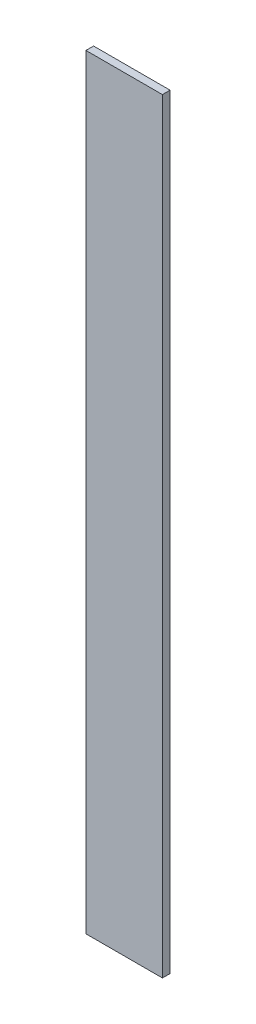
ISO-10303-21;
HEADER;
FILE_DESCRIPTION(('STEP AP214'),'2;1');
FILE_NAME('part.step','',(''),(''),'','','');
FILE_SCHEMA(('AUTOMOTIVE_DESIGN { 1 0 10303 214 1 1 1 1 }'));
ENDSEC;
DATA;
#1=APPLICATION_CONTEXT('core data for automotive mechanical design processes');
#2=APPLICATION_PROTOCOL_DEFINITION('international standard','automotive_design',2000,#1);
#3=PRODUCT_CONTEXT('',#1,'mechanical');
#4=PRODUCT('Part','Part','',(#3));
#5=PRODUCT_RELATED_PRODUCT_CATEGORY('part','',(#4));
#6=PRODUCT_DEFINITION_FORMATION('','',#4);
#7=PRODUCT_DEFINITION_CONTEXT('part definition',#1,'design');
#8=PRODUCT_DEFINITION('design','',#6,#7);
#9=PRODUCT_DEFINITION_SHAPE('','',#8);
#10=(LENGTH_UNIT() NAMED_UNIT(*) SI_UNIT(.MILLI.,.METRE.));
#11=(NAMED_UNIT(*) PLANE_ANGLE_UNIT() SI_UNIT($,.RADIAN.));
#12=(NAMED_UNIT(*) SI_UNIT($,.STERADIAN.) SOLID_ANGLE_UNIT());
#13=UNCERTAINTY_MEASURE_WITH_UNIT(LENGTH_MEASURE(1.E-05),#10,'distance_accuracy_value','');
#14=(GEOMETRIC_REPRESENTATION_CONTEXT(3) GLOBAL_UNCERTAINTY_ASSIGNED_CONTEXT((#13)) GLOBAL_UNIT_ASSIGNED_CONTEXT((#10,
#11,#12)) REPRESENTATION_CONTEXT('',''));
#15=CARTESIAN_POINT('',(0.,0.,0.));
#16=DIRECTION('',(0.,0.,1.));
#17=DIRECTION('',(1.,0.,0.));
#18=AXIS2_PLACEMENT_3D('',#15,#16,#17);
#19=CARTESIAN_POINT('',(10.,-100.,2.));
#20=DIRECTION('',(-1.,0.,0.));
#21=DIRECTION('',(0.,0.,1.));
#22=AXIS2_PLACEMENT_3D('',#19,#20,#21);
#23=PLANE('',#22);
#24=DIRECTION('',(0.,1.,0.));
#25=VECTOR('',#24,1.);
#26=CARTESIAN_POINT('',(10.,-100.,0.));
#27=LINE('',#26,#25);
#28=CARTESIAN_POINT('',(10.,-100.,0.));
#29=VERTEX_POINT('',#28);
#30=CARTESIAN_POINT('',(10.,100.,0.));
#31=VERTEX_POINT('',#30);
#32=EDGE_CURVE('E98',#29,#31,#27,.T.);
#33=ORIENTED_EDGE('',*,*,#32,.T.);
#34=DIRECTION('',(0.,0.,-1.));
#35=VECTOR('',#34,1.);
#36=CARTESIAN_POINT('',(10.,100.,2.));
#37=LINE('',#36,#35);
#38=CARTESIAN_POINT('',(10.,100.,2.));
#39=VERTEX_POINT('',#38);
#40=EDGE_CURVE('E11',#39,#31,#37,.T.);
#41=ORIENTED_EDGE('',*,*,#40,.F.);
#42=DIRECTION('',(0.,1.,0.));
#43=VECTOR('',#42,1.);
#44=CARTESIAN_POINT('',(10.,-100.,2.));
#45=LINE('',#44,#43);
#46=CARTESIAN_POINT('',(10.,-100.,2.));
#47=VERTEX_POINT('',#46);
#48=EDGE_CURVE('E86',#47,#39,#45,.T.);
#49=ORIENTED_EDGE('',*,*,#48,.F.);
#50=DIRECTION('',(0.,0.,-1.));
#51=VECTOR('',#50,1.);
#52=CARTESIAN_POINT('',(10.,-100.,2.));
#53=LINE('',#52,#51);
#54=EDGE_CURVE('E94',#47,#29,#53,.T.);
#55=ORIENTED_EDGE('',*,*,#54,.T.);
#56=EDGE_LOOP('',(#33,#41,#49,#55));
#57=FACE_BOUND('',#56,.T.);
#58=ADVANCED_FACE('F35',(#57),#23,.F.);
#59=CARTESIAN_POINT('',(-10.,100.,2.));
#60=DIRECTION('',(0.,-1.,0.));
#61=DIRECTION('',(0.,0.,-1.));
#62=AXIS2_PLACEMENT_3D('',#59,#60,#61);
#63=PLANE('',#62);
#64=DIRECTION('',(-1.,0.,0.));
#65=VECTOR('',#64,1.);
#66=CARTESIAN_POINT('',(-10.,100.,0.));
#67=LINE('',#66,#65);
#68=CARTESIAN_POINT('',(-10.,100.,0.));
#69=VERTEX_POINT('',#68);
#70=EDGE_CURVE('E90',#31,#69,#67,.T.);
#71=ORIENTED_EDGE('',*,*,#70,.T.);
#72=DIRECTION('',(0.,0.,-1.));
#73=VECTOR('',#72,1.);
#74=CARTESIAN_POINT('',(-10.,100.,2.));
#75=LINE('',#74,#73);
#76=CARTESIAN_POINT('',(-10.,100.,2.));
#77=VERTEX_POINT('',#76);
#78=EDGE_CURVE('E43',#77,#69,#75,.T.);
#79=ORIENTED_EDGE('',*,*,#78,.F.);
#80=DIRECTION('',(-1.,0.,0.));
#81=VECTOR('',#80,1.);
#82=CARTESIAN_POINT('',(-10.,100.,2.));
#83=LINE('',#82,#81);
#84=EDGE_CURVE('E81',#39,#77,#83,.T.);
#85=ORIENTED_EDGE('',*,*,#84,.F.);
#86=ORIENTED_EDGE('',*,*,#40,.T.);
#87=EDGE_LOOP('',(#71,#79,#85,#86));
#88=FACE_BOUND('',#87,.T.);
#89=ADVANCED_FACE('F89',(#88),#63,.F.);
#90=CARTESIAN_POINT('',(-10.,-100.,2.));
#91=DIRECTION('',(1.,0.,0.));
#92=DIRECTION('',(0.,0.,-1.));
#93=AXIS2_PLACEMENT_3D('',#90,#91,#92);
#94=PLANE('',#93);
#95=DIRECTION('',(0.,-1.,0.));
#96=VECTOR('',#95,1.);
#97=CARTESIAN_POINT('',(-10.,-100.,0.));
#98=LINE('',#97,#96);
#99=CARTESIAN_POINT('',(-10.,-100.,0.));
#100=VERTEX_POINT('',#99);
#101=EDGE_CURVE('E68',#69,#100,#98,.T.);
#102=ORIENTED_EDGE('',*,*,#101,.T.);
#103=DIRECTION('',(0.,0.,-1.));
#104=VECTOR('',#103,1.);
#105=CARTESIAN_POINT('',(-10.,-100.,2.));
#106=LINE('',#105,#104);
#107=CARTESIAN_POINT('',(-10.,-100.,2.));
#108=VERTEX_POINT('',#107);
#109=EDGE_CURVE('E91',#108,#100,#106,.T.);
#110=ORIENTED_EDGE('',*,*,#109,.F.);
#111=DIRECTION('',(0.,-1.,0.));
#112=VECTOR('',#111,1.);
#113=CARTESIAN_POINT('',(-10.,-100.,2.));
#114=LINE('',#113,#112);
#115=EDGE_CURVE('E84',#77,#108,#114,.T.);
#116=ORIENTED_EDGE('',*,*,#115,.F.);
#117=ORIENTED_EDGE('',*,*,#78,.T.);
#118=EDGE_LOOP('',(#102,#110,#116,#117));
#119=FACE_BOUND('',#118,.T.);
#120=ADVANCED_FACE('F92',(#119),#94,.F.);
#121=CARTESIAN_POINT('',(-10.,-100.,2.));
#122=DIRECTION('',(0.,1.,0.));
#123=DIRECTION('',(0.,0.,1.));
#124=AXIS2_PLACEMENT_3D('',#121,#122,#123);
#125=PLANE('',#124);
#126=DIRECTION('',(1.,0.,0.));
#127=VECTOR('',#126,1.);
#128=CARTESIAN_POINT('',(-10.,-100.,0.));
#129=LINE('',#128,#127);
#130=EDGE_CURVE('E74',#100,#29,#129,.T.);
#131=ORIENTED_EDGE('',*,*,#130,.T.);
#132=ORIENTED_EDGE('',*,*,#54,.F.);
#133=DIRECTION('',(1.,0.,0.));
#134=VECTOR('',#133,1.);
#135=CARTESIAN_POINT('',(-10.,-100.,2.));
#136=LINE('',#135,#134);
#137=EDGE_CURVE('E51',#108,#47,#136,.T.);
#138=ORIENTED_EDGE('',*,*,#137,.F.);
#139=ORIENTED_EDGE('',*,*,#109,.T.);
#140=EDGE_LOOP('',(#131,#132,#138,#139));
#141=FACE_BOUND('',#140,.T.);
#142=ADVANCED_FACE('F105',(#141),#125,.F.);
#143=CARTESIAN_POINT('',(0.,0.,2.));
#144=DIRECTION('',(0.,0.,-1.));
#145=DIRECTION('',(-1.,0.,0.));
#146=AXIS2_PLACEMENT_3D('',#143,#144,#145);
#147=PLANE('',#146);
#148=ORIENTED_EDGE('',*,*,#48,.T.);
#149=ORIENTED_EDGE('',*,*,#84,.T.);
#150=ORIENTED_EDGE('',*,*,#115,.T.);
#151=ORIENTED_EDGE('',*,*,#137,.T.);
#152=EDGE_LOOP('',(#148,#149,#150,#151));
#153=FACE_BOUND('',#152,.T.);
#154=ADVANCED_FACE('F82',(#153),#147,.F.);
#155=CARTESIAN_POINT('',(0.,0.,0.));
#156=DIRECTION('',(0.,0.,-1.));
#157=DIRECTION('',(-1.,0.,0.));
#158=AXIS2_PLACEMENT_3D('',#155,#156,#157);
#159=PLANE('',#158);
#160=ORIENTED_EDGE('',*,*,#32,.F.);
#161=ORIENTED_EDGE('',*,*,#130,.F.);
#162=ORIENTED_EDGE('',*,*,#101,.F.);
#163=ORIENTED_EDGE('',*,*,#70,.F.);
#164=EDGE_LOOP('',(#160,#161,#162,#163));
#165=FACE_BOUND('',#164,.T.);
#166=ADVANCED_FACE('F108',(#165),#159,.T.);
#167=CLOSED_SHELL('',(#58,#89,#120,#142,#154,#166));
#168=MANIFOLD_SOLID_BREP('B2',#167);
#169=ADVANCED_BREP_SHAPE_REPRESENTATION('',(#18,#168),#14);
#170=SHAPE_DEFINITION_REPRESENTATION(#9,#169);
ENDSEC;
END-ISO-10303-21;
